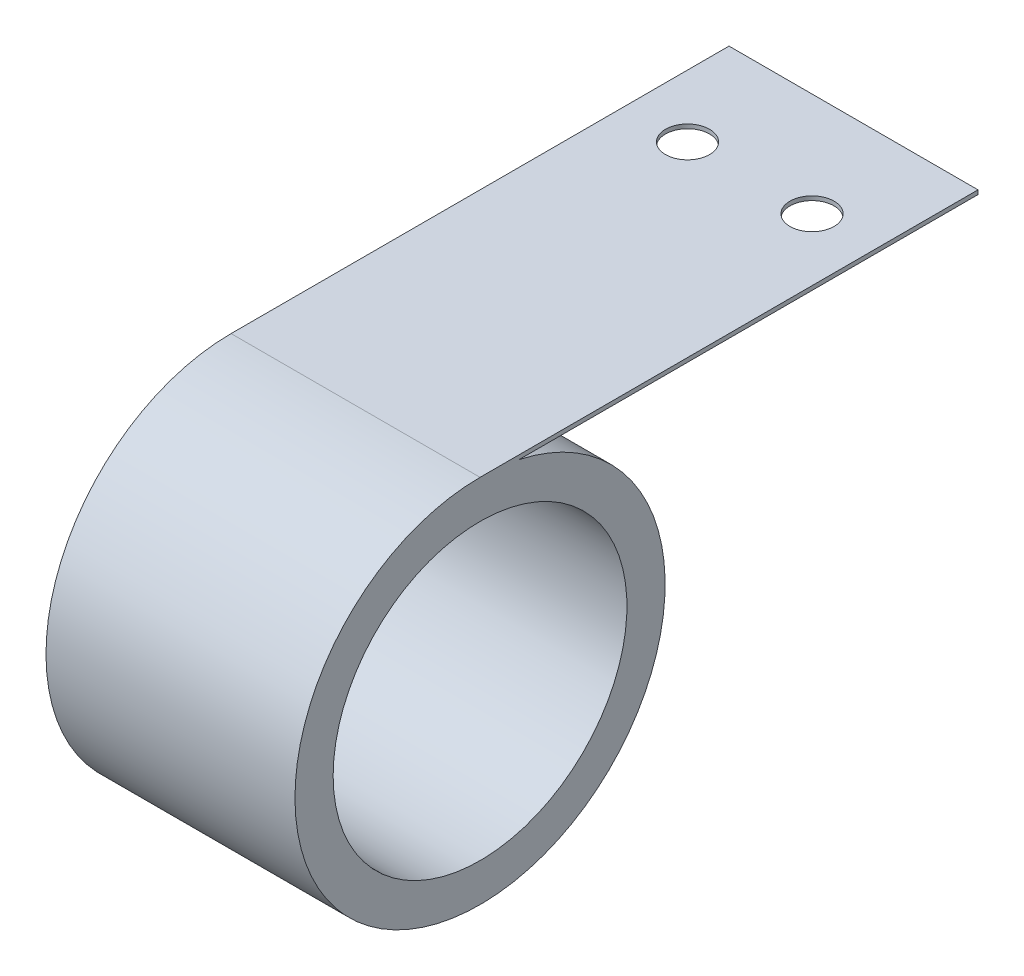
ISO-10303-21;
HEADER;
FILE_DESCRIPTION(('STEP AP214'),'2;1');
FILE_NAME('part.step','',(''),(''),'','','');
FILE_SCHEMA(('AUTOMOTIVE_DESIGN { 1 0 10303 214 1 1 1 1 }'));
ENDSEC;
DATA;
#1=APPLICATION_CONTEXT('core data for automotive mechanical design processes');
#2=APPLICATION_PROTOCOL_DEFINITION('international standard','automotive_design',2000,#1);
#3=PRODUCT_CONTEXT('',#1,'mechanical');
#4=PRODUCT('Part','Part','',(#3));
#5=PRODUCT_RELATED_PRODUCT_CATEGORY('part','',(#4));
#6=PRODUCT_DEFINITION_FORMATION('','',#4);
#7=PRODUCT_DEFINITION_CONTEXT('part definition',#1,'design');
#8=PRODUCT_DEFINITION('design','',#6,#7);
#9=PRODUCT_DEFINITION_SHAPE('','',#8);
#10=(LENGTH_UNIT() NAMED_UNIT(*) SI_UNIT(.MILLI.,.METRE.));
#11=(NAMED_UNIT(*) PLANE_ANGLE_UNIT() SI_UNIT($,.RADIAN.));
#12=(NAMED_UNIT(*) SI_UNIT($,.STERADIAN.) SOLID_ANGLE_UNIT());
#13=UNCERTAINTY_MEASURE_WITH_UNIT(LENGTH_MEASURE(1.E-05),#10,'distance_accuracy_value','');
#14=(GEOMETRIC_REPRESENTATION_CONTEXT(3) GLOBAL_UNCERTAINTY_ASSIGNED_CONTEXT((#13)) GLOBAL_UNIT_ASSIGNED_CONTEXT((#10,
#11,#12)) REPRESENTATION_CONTEXT('',''));
#15=CARTESIAN_POINT('',(0.,0.,0.));
#16=DIRECTION('',(0.,0.,1.));
#17=DIRECTION('',(1.,0.,0.));
#18=AXIS2_PLACEMENT_3D('',#15,#16,#17);
#19=CARTESIAN_POINT('',(19.05,0.,0.));
#20=DIRECTION('',(1.,0.,0.));
#21=DIRECTION('',(0.,0.,-1.));
#22=AXIS2_PLACEMENT_3D('',#19,#20,#21);
#23=PLANE('',#22);
#24=CARTESIAN_POINT('',(19.05,0.,0.));
#25=DIRECTION('',(1.,0.,0.));
#26=DIRECTION('',(0.,0.,-1.));
#27=AXIS2_PLACEMENT_3D('',#24,#25,#26);
#28=CIRCLE('',#27,28.321);
#29=CARTESIAN_POINT('',(19.05,28.321,0.));
#30=VERTEX_POINT('',#29);
#31=CARTESIAN_POINT('',(19.05,27.686,-5.96359329599195));
#32=VERTEX_POINT('',#31);
#33=EDGE_CURVE('E84',#30,#32,#28,.T.);
#34=ORIENTED_EDGE('',*,*,#33,.T.);
#35=DIRECTION('',(0.,0.,-1.));
#36=VECTOR('',#35,1.);
#37=CARTESIAN_POINT('',(19.05,27.686,-5.96359329599195));
#38=LINE('',#37,#36);
#39=CARTESIAN_POINT('',(19.05,27.686,-76.2));
#40=VERTEX_POINT('',#39);
#41=EDGE_CURVE('E79',#32,#40,#38,.T.);
#42=ORIENTED_EDGE('',*,*,#41,.T.);
#43=DIRECTION('',(0.,1.,0.));
#44=VECTOR('',#43,1.);
#45=CARTESIAN_POINT('',(19.05,27.686,-76.2));
#46=LINE('',#45,#44);
#47=CARTESIAN_POINT('',(19.05,28.321,-76.2));
#48=VERTEX_POINT('',#47);
#49=EDGE_CURVE('E82',#40,#48,#46,.T.);
#50=ORIENTED_EDGE('',*,*,#49,.T.);
#51=DIRECTION('',(0.,0.,1.));
#52=VECTOR('',#51,1.);
#53=CARTESIAN_POINT('',(19.05,28.321,0.));
#54=LINE('',#53,#52);
#55=EDGE_CURVE('E49',#48,#30,#54,.T.);
#56=ORIENTED_EDGE('',*,*,#55,.T.);
#57=EDGE_LOOP('',(#34,#42,#50,#56));
#58=FACE_BOUND('',#57,.T.);
#59=CARTESIAN_POINT('',(19.05,0.,0.));
#60=DIRECTION('',(1.,0.,0.));
#61=DIRECTION('',(0.,0.,-1.));
#62=AXIS2_PLACEMENT_3D('',#59,#60,#61);
#63=CIRCLE('',#62,22.479);
#64=CARTESIAN_POINT('',(19.05,0.,22.479));
#65=VERTEX_POINT('',#64);
#66=EDGE_CURVE('E99',#65,#65,#63,.T.);
#67=ORIENTED_EDGE('',*,*,#66,.F.);
#68=EDGE_LOOP('',(#67));
#69=FACE_BOUND('',#68,.T.);
#70=ADVANCED_FACE('F32',(#58,#69),#23,.T.);
#71=CARTESIAN_POINT('',(-19.05,0.,0.));
#72=DIRECTION('',(1.,0.,0.));
#73=DIRECTION('',(0.,0.,-1.));
#74=AXIS2_PLACEMENT_3D('',#71,#72,#73);
#75=PLANE('',#74);
#76=CARTESIAN_POINT('',(-19.05,0.,0.));
#77=DIRECTION('',(1.,0.,0.));
#78=DIRECTION('',(0.,0.,-1.));
#79=AXIS2_PLACEMENT_3D('',#76,#77,#78);
#80=CIRCLE('',#79,28.321);
#81=CARTESIAN_POINT('',(-19.05,28.321,0.));
#82=VERTEX_POINT('',#81);
#83=CARTESIAN_POINT('',(-19.05,27.686,-5.96359329599195));
#84=VERTEX_POINT('',#83);
#85=EDGE_CURVE('E96',#82,#84,#80,.T.);
#86=ORIENTED_EDGE('',*,*,#85,.F.);
#87=DIRECTION('',(0.,0.,1.));
#88=VECTOR('',#87,1.);
#89=CARTESIAN_POINT('',(-19.05,28.321,0.));
#90=LINE('',#89,#88);
#91=CARTESIAN_POINT('',(-19.05,28.321,-76.2));
#92=VERTEX_POINT('',#91);
#93=EDGE_CURVE('E72',#92,#82,#90,.T.);
#94=ORIENTED_EDGE('',*,*,#93,.F.);
#95=DIRECTION('',(0.,1.,0.));
#96=VECTOR('',#95,1.);
#97=CARTESIAN_POINT('',(-19.05,27.686,-76.2));
#98=LINE('',#97,#96);
#99=CARTESIAN_POINT('',(-19.05,27.686,-76.2));
#100=VERTEX_POINT('',#99);
#101=EDGE_CURVE('E66',#100,#92,#98,.T.);
#102=ORIENTED_EDGE('',*,*,#101,.F.);
#103=DIRECTION('',(0.,0.,-1.));
#104=VECTOR('',#103,1.);
#105=CARTESIAN_POINT('',(-19.05,27.686,-5.96359329599195));
#106=LINE('',#105,#104);
#107=EDGE_CURVE('E88',#84,#100,#106,.T.);
#108=ORIENTED_EDGE('',*,*,#107,.F.);
#109=EDGE_LOOP('',(#86,#94,#102,#108));
#110=FACE_BOUND('',#109,.T.);
#111=CARTESIAN_POINT('',(-19.05,0.,0.));
#112=DIRECTION('',(1.,0.,0.));
#113=DIRECTION('',(0.,0.,-1.));
#114=AXIS2_PLACEMENT_3D('',#111,#112,#113);
#115=CIRCLE('',#114,22.479);
#116=CARTESIAN_POINT('',(-19.05,0.,22.479));
#117=VERTEX_POINT('',#116);
#118=EDGE_CURVE('E111',#117,#117,#115,.T.);
#119=ORIENTED_EDGE('',*,*,#118,.T.);
#120=EDGE_LOOP('',(#119));
#121=FACE_BOUND('',#120,.T.);
#122=ADVANCED_FACE('F107',(#110,#121),#75,.F.);
#123=CARTESIAN_POINT('',(19.05,0.,0.));
#124=DIRECTION('',(-1.,0.,0.));
#125=DIRECTION('',(0.,0.,1.));
#126=AXIS2_PLACEMENT_3D('',#123,#124,#125);
#127=CYLINDRICAL_SURFACE('',#126,28.321);
#128=ORIENTED_EDGE('',*,*,#85,.T.);
#129=DIRECTION('',(-1.,0.,0.));
#130=VECTOR('',#129,1.);
#131=CARTESIAN_POINT('',(19.05,27.686,-5.96359329599195));
#132=LINE('',#131,#130);
#133=EDGE_CURVE('E11',#32,#84,#132,.T.);
#134=ORIENTED_EDGE('',*,*,#133,.F.);
#135=ORIENTED_EDGE('',*,*,#33,.F.);
#136=DIRECTION('',(-1.,0.,0.));
#137=VECTOR('',#136,1.);
#138=CARTESIAN_POINT('',(19.05,28.321,0.));
#139=LINE('',#138,#137);
#140=EDGE_CURVE('E92',#30,#82,#139,.T.);
#141=ORIENTED_EDGE('',*,*,#140,.T.);
#142=EDGE_LOOP('',(#128,#134,#135,#141));
#143=FACE_BOUND('',#142,.T.);
#144=ADVANCED_FACE('F34',(#143),#127,.T.);
#145=CARTESIAN_POINT('',(19.05,27.686,-5.96359329599195));
#146=DIRECTION('',(0.,1.,0.));
#147=DIRECTION('',(0.,0.,1.));
#148=AXIS2_PLACEMENT_3D('',#145,#146,#147);
#149=PLANE('',#148);
#150=CARTESIAN_POINT('',(9.525,27.686,-60.325));
#151=DIRECTION('',(0.,1.,0.));
#152=DIRECTION('',(0.,0.,1.));
#153=AXIS2_PLACEMENT_3D('',#150,#151,#152);
#154=CIRCLE('',#153,3.3655);
#155=CARTESIAN_POINT('',(9.525,27.686,-56.9595));
#156=VERTEX_POINT('',#155);
#157=EDGE_CURVE('E122',#156,#156,#154,.F.);
#158=ORIENTED_EDGE('',*,*,#157,.F.);
#159=EDGE_LOOP('',(#158));
#160=FACE_BOUND('',#159,.T.);
#161=CARTESIAN_POINT('',(-9.525,27.686,-60.325));
#162=DIRECTION('',(0.,1.,0.));
#163=DIRECTION('',(0.,0.,1.));
#164=AXIS2_PLACEMENT_3D('',#161,#162,#163);
#165=CIRCLE('',#164,3.3655);
#166=CARTESIAN_POINT('',(-9.525,27.686,-56.9595));
#167=VERTEX_POINT('',#166);
#168=EDGE_CURVE('E114',#167,#167,#165,.F.);
#169=ORIENTED_EDGE('',*,*,#168,.F.);
#170=EDGE_LOOP('',(#169));
#171=FACE_BOUND('',#170,.T.);
#172=ORIENTED_EDGE('',*,*,#107,.T.);
#173=DIRECTION('',(-1.,0.,0.));
#174=VECTOR('',#173,1.);
#175=CARTESIAN_POINT('',(19.05,27.686,-76.2));
#176=LINE('',#175,#174);
#177=EDGE_CURVE('E41',#40,#100,#176,.T.);
#178=ORIENTED_EDGE('',*,*,#177,.F.);
#179=ORIENTED_EDGE('',*,*,#41,.F.);
#180=ORIENTED_EDGE('',*,*,#133,.T.);
#181=EDGE_LOOP('',(#172,#178,#179,#180));
#182=FACE_BOUND('',#181,.T.);
#183=ADVANCED_FACE('F87',(#160,#171,#182),#149,.F.);
#184=CARTESIAN_POINT('',(19.05,27.686,-76.2));
#185=DIRECTION('',(0.,0.,1.));
#186=DIRECTION('',(1.,0.,0.));
#187=AXIS2_PLACEMENT_3D('',#184,#185,#186);
#188=PLANE('',#187);
#189=ORIENTED_EDGE('',*,*,#101,.T.);
#190=DIRECTION('',(-1.,0.,0.));
#191=VECTOR('',#190,1.);
#192=CARTESIAN_POINT('',(19.05,28.321,-76.2));
#193=LINE('',#192,#191);
#194=EDGE_CURVE('E89',#48,#92,#193,.T.);
#195=ORIENTED_EDGE('',*,*,#194,.F.);
#196=ORIENTED_EDGE('',*,*,#49,.F.);
#197=ORIENTED_EDGE('',*,*,#177,.T.);
#198=EDGE_LOOP('',(#189,#195,#196,#197));
#199=FACE_BOUND('',#198,.T.);
#200=ADVANCED_FACE('F90',(#199),#188,.F.);
#201=CARTESIAN_POINT('',(19.05,28.321,0.));
#202=DIRECTION('',(0.,-1.,0.));
#203=DIRECTION('',(0.,0.,-1.));
#204=AXIS2_PLACEMENT_3D('',#201,#202,#203);
#205=PLANE('',#204);
#206=CARTESIAN_POINT('',(9.525,28.321,-60.325));
#207=DIRECTION('',(0.,1.,0.));
#208=DIRECTION('',(0.,0.,1.));
#209=AXIS2_PLACEMENT_3D('',#206,#207,#208);
#210=CIRCLE('',#209,3.3655);
#211=CARTESIAN_POINT('',(9.525,28.321,-56.9595));
#212=VERTEX_POINT('',#211);
#213=EDGE_CURVE('E125',#212,#212,#210,.T.);
#214=ORIENTED_EDGE('',*,*,#213,.F.);
#215=EDGE_LOOP('',(#214));
#216=FACE_BOUND('',#215,.T.);
#217=CARTESIAN_POINT('',(-9.525,28.321,-60.325));
#218=DIRECTION('',(0.,1.,0.));
#219=DIRECTION('',(0.,0.,1.));
#220=AXIS2_PLACEMENT_3D('',#217,#218,#219);
#221=CIRCLE('',#220,3.3655);
#222=CARTESIAN_POINT('',(-9.525,28.321,-56.9595));
#223=VERTEX_POINT('',#222);
#224=EDGE_CURVE('E119',#223,#223,#221,.T.);
#225=ORIENTED_EDGE('',*,*,#224,.F.);
#226=EDGE_LOOP('',(#225));
#227=FACE_BOUND('',#226,.T.);
#228=ORIENTED_EDGE('',*,*,#93,.T.);
#229=ORIENTED_EDGE('',*,*,#140,.F.);
#230=ORIENTED_EDGE('',*,*,#55,.F.);
#231=ORIENTED_EDGE('',*,*,#194,.T.);
#232=EDGE_LOOP('',(#228,#229,#230,#231));
#233=FACE_BOUND('',#232,.T.);
#234=ADVANCED_FACE('F104',(#216,#227,#233),#205,.F.);
#235=CARTESIAN_POINT('',(19.05,0.,0.));
#236=DIRECTION('',(-1.,0.,0.));
#237=DIRECTION('',(0.,0.,1.));
#238=AXIS2_PLACEMENT_3D('',#235,#236,#237);
#239=CYLINDRICAL_SURFACE('',#238,22.479);
#240=CARTESIAN_POINT('',(19.05,0.,22.479));
#241=CARTESIAN_POINT('',(18.653125,0.,22.479));
#242=CARTESIAN_POINT('',(18.25625,0.,22.479));
#243=CARTESIAN_POINT('',(17.4625,0.,22.479));
#244=CARTESIAN_POINT('',(17.065625,0.,22.479));
#245=CARTESIAN_POINT('',(16.271875,0.,22.479));
#246=CARTESIAN_POINT('',(15.875,0.,22.479));
#247=CARTESIAN_POINT('',(15.08125,0.,22.479));
#248=CARTESIAN_POINT('',(14.684375,0.,22.479));
#249=CARTESIAN_POINT('',(13.890625,0.,22.479));
#250=CARTESIAN_POINT('',(13.49375,0.,22.479));
#251=CARTESIAN_POINT('',(12.7,0.,22.479));
#252=CARTESIAN_POINT('',(12.303125,0.,22.479));
#253=CARTESIAN_POINT('',(11.509375,0.,22.479));
#254=CARTESIAN_POINT('',(11.1125,0.,22.479));
#255=CARTESIAN_POINT('',(10.31875,0.,22.479));
#256=CARTESIAN_POINT('',(9.921875,0.,22.479));
#257=CARTESIAN_POINT('',(9.128125,0.,22.479));
#258=CARTESIAN_POINT('',(8.73125,0.,22.479));
#259=CARTESIAN_POINT('',(7.9375,0.,22.479));
#260=CARTESIAN_POINT('',(7.540625,0.,22.479));
#261=CARTESIAN_POINT('',(6.746875,0.,22.479));
#262=CARTESIAN_POINT('',(6.35,0.,22.479));
#263=CARTESIAN_POINT('',(5.55625,0.,22.479));
#264=CARTESIAN_POINT('',(5.159375,0.,22.479));
#265=CARTESIAN_POINT('',(4.365625,0.,22.479));
#266=CARTESIAN_POINT('',(3.96875,0.,22.479));
#267=CARTESIAN_POINT('',(3.175,0.,22.479));
#268=CARTESIAN_POINT('',(2.778125,0.,22.479));
#269=CARTESIAN_POINT('',(1.984375,0.,22.479));
#270=CARTESIAN_POINT('',(1.5875,0.,22.479));
#271=CARTESIAN_POINT('',(0.793749999999997,0.,22.479));
#272=CARTESIAN_POINT('',(0.396874999999997,0.,22.479));
#273=CARTESIAN_POINT('',(-0.396875000000004,0.,22.479));
#274=CARTESIAN_POINT('',(-0.793750000000004,0.,22.479));
#275=CARTESIAN_POINT('',(-1.5875,0.,22.479));
#276=CARTESIAN_POINT('',(-1.984375,0.,22.479));
#277=CARTESIAN_POINT('',(-2.77812500000001,0.,22.479));
#278=CARTESIAN_POINT('',(-3.17500000000001,0.,22.479));
#279=CARTESIAN_POINT('',(-3.96875000000001,0.,22.479));
#280=CARTESIAN_POINT('',(-4.36562500000001,0.,22.479));
#281=CARTESIAN_POINT('',(-5.15937500000001,0.,22.479));
#282=CARTESIAN_POINT('',(-5.55625,0.,22.479));
#283=CARTESIAN_POINT('',(-6.35,0.,22.479));
#284=CARTESIAN_POINT('',(-6.746875,0.,22.479));
#285=CARTESIAN_POINT('',(-7.540625,0.,22.479));
#286=CARTESIAN_POINT('',(-7.93750000000001,0.,22.479));
#287=CARTESIAN_POINT('',(-8.73125,0.,22.479));
#288=CARTESIAN_POINT('',(-9.12812500000001,0.,22.479));
#289=CARTESIAN_POINT('',(-9.92187500000001,0.,22.479));
#290=CARTESIAN_POINT('',(-10.31875,0.,22.479));
#291=CARTESIAN_POINT('',(-11.1125,0.,22.479));
#292=CARTESIAN_POINT('',(-11.509375,0.,22.479));
#293=CARTESIAN_POINT('',(-12.303125,0.,22.479));
#294=CARTESIAN_POINT('',(-12.7,0.,22.479));
#295=CARTESIAN_POINT('',(-13.49375,0.,22.479));
#296=CARTESIAN_POINT('',(-13.890625,0.,22.479));
#297=CARTESIAN_POINT('',(-14.684375,0.,22.479));
#298=CARTESIAN_POINT('',(-15.08125,0.,22.479));
#299=CARTESIAN_POINT('',(-15.875,0.,22.479));
#300=CARTESIAN_POINT('',(-16.271875,0.,22.479));
#301=CARTESIAN_POINT('',(-17.065625,0.,22.479));
#302=CARTESIAN_POINT('',(-17.4625,0.,22.479));
#303=CARTESIAN_POINT('',(-18.25625,0.,22.479));
#304=CARTESIAN_POINT('',(-18.653125,0.,22.479));
#305=CARTESIAN_POINT('',(-19.05,0.,22.479));
#306=B_SPLINE_CURVE_WITH_KNOTS('',3,(#240,#241,#242,#243,#244,#245,#246,#247,#248,#249,#250,
#251,#252,#253,#254,#255,#256,#257,#258,#259,#260,#261,#262,#263,#264,#265,#266,#267,#268,#269,
#270,#271,#272,#273,#274,#275,#276,#277,#278,#279,#280,#281,#282,#283,#284,#285,#286,#287,#288,
#289,#290,#291,#292,#293,#294,#295,#296,#297,#298,#299,#300,#301,#302,#303,#304,#305),
.UNSPECIFIED.,.F.,.F.,(4,2,2,2,2,2,2,2,2,2,2,2,2,2,2,2,2,2,2,2,2,2,2,2,2,2,2,2,2,2,2,2,4),(0.,
1.190625,2.38125,3.571875,4.7625,5.953125,7.14375,8.334375,9.525,10.715625,11.90625,13.096875,
14.2875,15.478125,16.66875,17.859375,19.05,20.240625,21.43125,22.621875,23.8125,25.003125,
26.19375,27.384375,28.575,29.765625,30.95625,32.146875,33.3375,34.528125,35.71875,36.909375,
38.1),.UNSPECIFIED.);
#307=EDGE_CURVE('BSEAM134',#65,#117,#306,.T.);
#308=ORIENTED_EDGE('',*,*,#66,.T.);
#309=ORIENTED_EDGE('',*,*,#118,.F.);
#310=ORIENTED_EDGE('',*,*,#307,.T.);
#311=ORIENTED_EDGE('',*,*,#307,.F.);
#312=EDGE_LOOP('',(#308,#310,#309,#311));
#313=FACE_BOUND('',#312,.T.);
#314=ADVANCED_FACE('F134',(#313),#239,.F.);
#315=CARTESIAN_POINT('',(-9.525,-28.322,-60.325));
#316=DIRECTION('',(0.,1.,0.));
#317=DIRECTION('',(0.,0.,1.));
#318=AXIS2_PLACEMENT_3D('',#315,#316,#317);
#319=CYLINDRICAL_SURFACE('',#318,3.3655);
#320=ORIENTED_EDGE('',*,*,#224,.T.);
#321=EDGE_LOOP('',(#320));
#322=FACE_BOUND('',#321,.T.);
#323=ORIENTED_EDGE('',*,*,#168,.T.);
#324=EDGE_LOOP('',(#323));
#325=FACE_BOUND('',#324,.T.);
#326=ADVANCED_FACE('F138',(#322,#325),#319,.F.);
#327=CARTESIAN_POINT('',(9.525,-28.322,-60.325));
#328=DIRECTION('',(0.,1.,0.));
#329=DIRECTION('',(0.,0.,1.));
#330=AXIS2_PLACEMENT_3D('',#327,#328,#329);
#331=CYLINDRICAL_SURFACE('',#330,3.3655);
#332=ORIENTED_EDGE('',*,*,#213,.T.);
#333=EDGE_LOOP('',(#332));
#334=FACE_BOUND('',#333,.T.);
#335=ORIENTED_EDGE('',*,*,#157,.T.);
#336=EDGE_LOOP('',(#335));
#337=FACE_BOUND('',#336,.T.);
#338=ADVANCED_FACE('F129',(#334,#337),#331,.F.);
#339=CLOSED_SHELL('',(#70,#122,#144,#183,#200,#234,#314,#326,#338));
#340=MANIFOLD_SOLID_BREP('B2',#339);
#341=ADVANCED_BREP_SHAPE_REPRESENTATION('',(#18,#340),#14);
#342=SHAPE_DEFINITION_REPRESENTATION(#9,#341);
ENDSEC;
END-ISO-10303-21;
